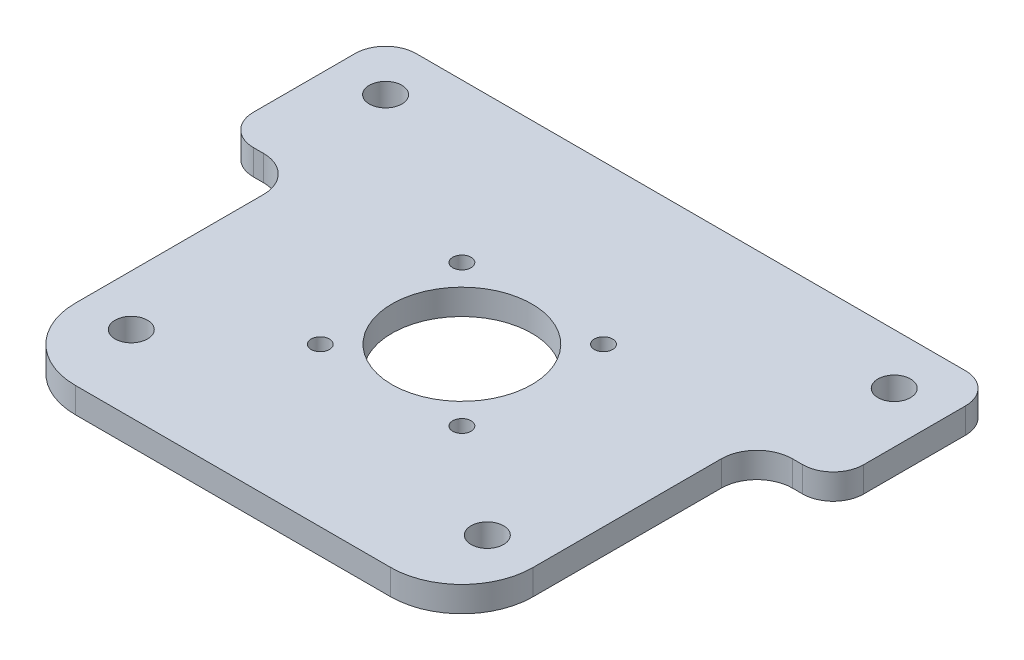
ISO-10303-21;
HEADER;
FILE_DESCRIPTION(('STEP AP214'),'2;1');
FILE_NAME('part.step','',(''),(''),'','','');
FILE_SCHEMA(('AUTOMOTIVE_DESIGN { 1 0 10303 214 1 1 1 1 }'));
ENDSEC;
DATA;
#1=APPLICATION_CONTEXT('core data for automotive mechanical design processes');
#2=APPLICATION_PROTOCOL_DEFINITION('international standard','automotive_design',2000,#1);
#3=PRODUCT_CONTEXT('',#1,'mechanical');
#4=PRODUCT('Part','Part','',(#3));
#5=PRODUCT_RELATED_PRODUCT_CATEGORY('part','',(#4));
#6=PRODUCT_DEFINITION_FORMATION('','',#4);
#7=PRODUCT_DEFINITION_CONTEXT('part definition',#1,'design');
#8=PRODUCT_DEFINITION('design','',#6,#7);
#9=PRODUCT_DEFINITION_SHAPE('','',#8);
#10=(LENGTH_UNIT() NAMED_UNIT(*) SI_UNIT(.MILLI.,.METRE.));
#11=(NAMED_UNIT(*) PLANE_ANGLE_UNIT() SI_UNIT($,.RADIAN.));
#12=(NAMED_UNIT(*) SI_UNIT($,.STERADIAN.) SOLID_ANGLE_UNIT());
#13=UNCERTAINTY_MEASURE_WITH_UNIT(LENGTH_MEASURE(1.E-05),#10,'distance_accuracy_value','');
#14=(GEOMETRIC_REPRESENTATION_CONTEXT(3) GLOBAL_UNCERTAINTY_ASSIGNED_CONTEXT((#13)) GLOBAL_UNIT_ASSIGNED_CONTEXT((#10,
#11,#12)) REPRESENTATION_CONTEXT('',''));
#15=CARTESIAN_POINT('',(0.,0.,0.));
#16=DIRECTION('',(0.,0.,1.));
#17=DIRECTION('',(1.,0.,0.));
#18=AXIS2_PLACEMENT_3D('',#15,#16,#17);
#19=CARTESIAN_POINT('',(-57.15,6.35,-57.15));
#20=DIRECTION('',(1.,0.,0.));
#21=DIRECTION('',(0.,0.,-1.));
#22=AXIS2_PLACEMENT_3D('',#19,#20,#21);
#23=PLANE('',#22);
#24=DIRECTION('',(0.,0.,1.));
#25=VECTOR('',#24,1.);
#26=CARTESIAN_POINT('',(-57.15,0.,-57.15));
#27=LINE('',#26,#25);
#28=CARTESIAN_POINT('',(-57.15,0.,-7.62));
#29=VERTEX_POINT('',#28);
#30=CARTESIAN_POINT('',(-57.15,0.,39.37));
#31=VERTEX_POINT('',#30);
#32=EDGE_CURVE('E212',#29,#31,#27,.T.);
#33=ORIENTED_EDGE('',*,*,#32,.T.);
#34=DIRECTION('',(0.,-1.,0.));
#35=VECTOR('',#34,1.);
#36=CARTESIAN_POINT('',(-57.15,6.35,39.37));
#37=LINE('',#36,#35);
#38=CARTESIAN_POINT('',(-57.15,6.35,39.37));
#39=VERTEX_POINT('',#38);
#40=EDGE_CURVE('E305',#31,#39,#37,.F.);
#41=ORIENTED_EDGE('',*,*,#40,.T.);
#42=DIRECTION('',(0.,0.,1.));
#43=VECTOR('',#42,1.);
#44=CARTESIAN_POINT('',(-57.15,6.35,-57.15));
#45=LINE('',#44,#43);
#46=CARTESIAN_POINT('',(-57.15,6.35,-7.62));
#47=VERTEX_POINT('',#46);
#48=EDGE_CURVE('E284',#47,#39,#45,.T.);
#49=ORIENTED_EDGE('',*,*,#48,.F.);
#50=DIRECTION('',(0.,1.,0.));
#51=VECTOR('',#50,1.);
#52=CARTESIAN_POINT('',(-57.15,6.35,-7.62));
#53=LINE('',#52,#51);
#54=EDGE_CURVE('E290',#47,#29,#53,.F.);
#55=ORIENTED_EDGE('',*,*,#54,.T.);
#56=EDGE_LOOP('',(#33,#41,#49,#55));
#57=FACE_BOUND('',#56,.T.);
#58=ADVANCED_FACE('F45',(#57),#23,.F.);
#59=CARTESIAN_POINT('',(57.15,6.35,-57.15));
#60=DIRECTION('',(1.,0.,0.));
#61=DIRECTION('',(0.,0.,-1.));
#62=AXIS2_PLACEMENT_3D('',#59,#60,#61);
#63=PLANE('',#62);
#64=DIRECTION('',(0.,0.,1.));
#65=VECTOR('',#64,1.);
#66=CARTESIAN_POINT('',(57.15,6.35,-57.15));
#67=LINE('',#66,#65);
#68=CARTESIAN_POINT('',(57.15,6.35,-7.62));
#69=VERTEX_POINT('',#68);
#70=CARTESIAN_POINT('',(57.15,6.35,39.37));
#71=VERTEX_POINT('',#70);
#72=EDGE_CURVE('E190',#69,#71,#67,.T.);
#73=ORIENTED_EDGE('',*,*,#72,.T.);
#74=DIRECTION('',(0.,-1.,0.));
#75=VECTOR('',#74,1.);
#76=CARTESIAN_POINT('',(57.15,0.,39.37));
#77=LINE('',#76,#75);
#78=CARTESIAN_POINT('',(57.15,0.,39.37));
#79=VERTEX_POINT('',#78);
#80=EDGE_CURVE('E180',#71,#79,#77,.T.);
#81=ORIENTED_EDGE('',*,*,#80,.T.);
#82=DIRECTION('',(0.,0.,1.));
#83=VECTOR('',#82,1.);
#84=CARTESIAN_POINT('',(57.15,0.,-57.15));
#85=LINE('',#84,#83);
#86=CARTESIAN_POINT('',(57.15,0.,-7.62));
#87=VERTEX_POINT('',#86);
#88=EDGE_CURVE('E162',#87,#79,#85,.T.);
#89=ORIENTED_EDGE('',*,*,#88,.F.);
#90=DIRECTION('',(0.,1.,0.));
#91=VECTOR('',#90,1.);
#92=CARTESIAN_POINT('',(57.15,6.34999999999999,-7.62));
#93=LINE('',#92,#91);
#94=EDGE_CURVE('E177',#87,#69,#93,.T.);
#95=ORIENTED_EDGE('',*,*,#94,.T.);
#96=EDGE_LOOP('',(#73,#81,#89,#95));
#97=FACE_BOUND('',#96,.T.);
#98=ADVANCED_FACE('F176',(#97),#63,.T.);
#99=CARTESIAN_POINT('',(-57.15,6.35,57.15));
#100=DIRECTION('',(0.,0.,-1.));
#101=DIRECTION('',(-1.,0.,0.));
#102=AXIS2_PLACEMENT_3D('',#99,#100,#101);
#103=PLANE('',#102);
#104=DIRECTION('',(1.,0.,0.));
#105=VECTOR('',#104,1.);
#106=CARTESIAN_POINT('',(-57.15,6.35,57.15));
#107=LINE('',#106,#105);
#108=CARTESIAN_POINT('',(-39.37,6.35,57.15));
#109=VERTEX_POINT('',#108);
#110=CARTESIAN_POINT('',(39.37,6.35,57.15));
#111=VERTEX_POINT('',#110);
#112=EDGE_CURVE('E282',#109,#111,#107,.T.);
#113=ORIENTED_EDGE('',*,*,#112,.F.);
#114=DIRECTION('',(0.,-1.,0.));
#115=VECTOR('',#114,1.);
#116=CARTESIAN_POINT('',(-39.37,6.35,57.15));
#117=LINE('',#116,#115);
#118=CARTESIAN_POINT('',(-39.37,0.,57.15));
#119=VERTEX_POINT('',#118);
#120=EDGE_CURVE('E298',#109,#119,#117,.T.);
#121=ORIENTED_EDGE('',*,*,#120,.T.);
#122=DIRECTION('',(1.,0.,0.));
#123=VECTOR('',#122,1.);
#124=CARTESIAN_POINT('',(-57.15,0.,57.15));
#125=LINE('',#124,#123);
#126=CARTESIAN_POINT('',(39.37,0.,57.15));
#127=VERTEX_POINT('',#126);
#128=EDGE_CURVE('E182',#119,#127,#125,.T.);
#129=ORIENTED_EDGE('',*,*,#128,.T.);
#130=DIRECTION('',(0.,-1.,0.));
#131=VECTOR('',#130,1.);
#132=CARTESIAN_POINT('',(39.37,6.35,57.15));
#133=LINE('',#132,#131);
#134=EDGE_CURVE('E296',#127,#111,#133,.F.);
#135=ORIENTED_EDGE('',*,*,#134,.T.);
#136=EDGE_LOOP('',(#113,#121,#129,#135));
#137=FACE_BOUND('',#136,.T.);
#138=ADVANCED_FACE('F318',(#137),#103,.F.);
#139=CARTESIAN_POINT('',(-57.15,6.35,-57.15));
#140=DIRECTION('',(0.,0.,-1.));
#141=DIRECTION('',(-1.,0.,0.));
#142=AXIS2_PLACEMENT_3D('',#139,#140,#141);
#143=PLANE('',#142);
#144=DIRECTION('',(1.,0.,0.));
#145=VECTOR('',#144,1.);
#146=CARTESIAN_POINT('',(-57.15,6.35,-57.15));
#147=LINE('',#146,#145);
#148=CARTESIAN_POINT('',(-68.58,6.35,-57.15));
#149=VERTEX_POINT('',#148);
#150=CARTESIAN_POINT('',(68.58,6.35,-57.15));
#151=VERTEX_POINT('',#150);
#152=EDGE_CURVE('E186',#149,#151,#147,.T.);
#153=ORIENTED_EDGE('',*,*,#152,.T.);
#154=DIRECTION('',(0.,1.,0.));
#155=VECTOR('',#154,1.);
#156=CARTESIAN_POINT('',(68.58,6.35,-57.15));
#157=LINE('',#156,#155);
#158=CARTESIAN_POINT('',(68.58,0.,-57.15));
#159=VERTEX_POINT('',#158);
#160=EDGE_CURVE('E60',#151,#159,#157,.F.);
#161=ORIENTED_EDGE('',*,*,#160,.T.);
#162=DIRECTION('',(1.,0.,0.));
#163=VECTOR('',#162,1.);
#164=CARTESIAN_POINT('',(-57.15,0.,-57.15));
#165=LINE('',#164,#163);
#166=CARTESIAN_POINT('',(-68.58,0.,-57.15));
#167=VERTEX_POINT('',#166);
#168=EDGE_CURVE('E181',#167,#159,#165,.T.);
#169=ORIENTED_EDGE('',*,*,#168,.F.);
#170=DIRECTION('',(0.,1.,0.));
#171=VECTOR('',#170,1.);
#172=CARTESIAN_POINT('',(-68.58,6.35,-57.15));
#173=LINE('',#172,#171);
#174=EDGE_CURVE('E242',#167,#149,#173,.T.);
#175=ORIENTED_EDGE('',*,*,#174,.T.);
#176=EDGE_LOOP('',(#153,#161,#169,#175));
#177=FACE_BOUND('',#176,.T.);
#178=ADVANCED_FACE('F262',(#177),#143,.T.);
#179=CARTESIAN_POINT('',(0.,6.35,0.));
#180=DIRECTION('',(0.,1.,0.));
#181=DIRECTION('',(0.,0.,1.));
#182=AXIS2_PLACEMENT_3D('',#179,#180,#181);
#183=PLANE('',#182);
#184=CARTESIAN_POINT('',(-17.6776695296637,6.35,17.6776695296637));
#185=DIRECTION('',(0.,1.,0.));
#186=DIRECTION('',(0.,0.,1.));
#187=AXIS2_PLACEMENT_3D('',#184,#185,#186);
#188=CIRCLE('',#187,2.286);
#189=CARTESIAN_POINT('',(-17.6776695296637,6.35,19.9636695296637));
#190=VERTEX_POINT('',#189);
#191=EDGE_CURVE('E336',#190,#190,#188,.T.);
#192=ORIENTED_EDGE('',*,*,#191,.F.);
#193=EDGE_LOOP('',(#192));
#194=FACE_BOUND('',#193,.T.);
#195=CARTESIAN_POINT('',(17.6776695296637,6.35,17.6776695296637));
#196=DIRECTION('',(0.,1.,0.));
#197=DIRECTION('',(0.,0.,1.));
#198=AXIS2_PLACEMENT_3D('',#195,#196,#197);
#199=CIRCLE('',#198,2.286);
#200=CARTESIAN_POINT('',(17.6776695296637,6.35,19.9636695296637));
#201=VERTEX_POINT('',#200);
#202=EDGE_CURVE('E335',#201,#201,#199,.T.);
#203=ORIENTED_EDGE('',*,*,#202,.F.);
#204=EDGE_LOOP('',(#203));
#205=FACE_BOUND('',#204,.T.);
#206=CARTESIAN_POINT('',(17.6776695296637,6.35,-17.6776695296637));
#207=DIRECTION('',(0.,1.,0.));
#208=DIRECTION('',(0.,0.,1.));
#209=AXIS2_PLACEMENT_3D('',#206,#207,#208);
#210=CIRCLE('',#209,2.286);
#211=CARTESIAN_POINT('',(17.6776695296637,6.35,-15.3916695296637));
#212=VERTEX_POINT('',#211);
#213=EDGE_CURVE('E340',#212,#212,#210,.T.);
#214=ORIENTED_EDGE('',*,*,#213,.F.);
#215=EDGE_LOOP('',(#214));
#216=FACE_BOUND('',#215,.T.);
#217=CARTESIAN_POINT('',(-17.6776695296637,6.35,-17.6776695296637));
#218=DIRECTION('',(0.,1.,0.));
#219=DIRECTION('',(0.,0.,1.));
#220=AXIS2_PLACEMENT_3D('',#217,#218,#219);
#221=CIRCLE('',#220,2.286);
#222=CARTESIAN_POINT('',(-17.6776695296637,6.35,-15.3916695296637));
#223=VERTEX_POINT('',#222);
#224=EDGE_CURVE('E344',#223,#223,#221,.T.);
#225=ORIENTED_EDGE('',*,*,#224,.F.);
#226=EDGE_LOOP('',(#225));
#227=FACE_BOUND('',#226,.T.);
#228=CARTESIAN_POINT('',(0.,6.35,0.));
#229=DIRECTION('',(0.,1.,0.));
#230=DIRECTION('',(0.,0.,1.));
#231=AXIS2_PLACEMENT_3D('',#228,#229,#230);
#232=CIRCLE('',#231,17.4625);
#233=CARTESIAN_POINT('',(0.,6.35,17.4625));
#234=VERTEX_POINT('',#233);
#235=EDGE_CURVE('E348',#234,#234,#232,.T.);
#236=ORIENTED_EDGE('',*,*,#235,.F.);
#237=EDGE_LOOP('',(#236));
#238=FACE_BOUND('',#237,.T.);
#239=CARTESIAN_POINT('',(-44.45,6.35,38.1));
#240=DIRECTION('',(0.,1.,0.));
#241=DIRECTION('',(0.,0.,1.));
#242=AXIS2_PLACEMENT_3D('',#239,#240,#241);
#243=CIRCLE('',#242,4.06400000000001);
#244=CARTESIAN_POINT('',(-44.45,6.35,42.164));
#245=VERTEX_POINT('',#244);
#246=EDGE_CURVE('E352',#245,#245,#243,.T.);
#247=ORIENTED_EDGE('',*,*,#246,.F.);
#248=EDGE_LOOP('',(#247));
#249=FACE_BOUND('',#248,.T.);
#250=CARTESIAN_POINT('',(44.45,6.35,38.1));
#251=DIRECTION('',(0.,1.,0.));
#252=DIRECTION('',(0.,0.,1.));
#253=AXIS2_PLACEMENT_3D('',#250,#251,#252);
#254=CIRCLE('',#253,4.06400000000001);
#255=CARTESIAN_POINT('',(44.45,6.35,42.164));
#256=VERTEX_POINT('',#255);
#257=EDGE_CURVE('E356',#256,#256,#254,.T.);
#258=ORIENTED_EDGE('',*,*,#257,.F.);
#259=EDGE_LOOP('',(#258));
#260=FACE_BOUND('',#259,.T.);
#261=CARTESIAN_POINT('',(63.5,6.35,-44.45));
#262=DIRECTION('',(0.,1.,0.));
#263=DIRECTION('',(0.,0.,1.));
#264=AXIS2_PLACEMENT_3D('',#261,#262,#263);
#265=CIRCLE('',#264,4.064);
#266=CARTESIAN_POINT('',(63.5,6.35,-40.386));
#267=VERTEX_POINT('',#266);
#268=EDGE_CURVE('E360',#267,#267,#265,.T.);
#269=ORIENTED_EDGE('',*,*,#268,.F.);
#270=EDGE_LOOP('',(#269));
#271=FACE_BOUND('',#270,.T.);
#272=CARTESIAN_POINT('',(-63.5,6.35,-44.45));
#273=DIRECTION('',(0.,1.,0.));
#274=DIRECTION('',(0.,0.,1.));
#275=AXIS2_PLACEMENT_3D('',#272,#273,#274);
#276=CIRCLE('',#275,4.064);
#277=CARTESIAN_POINT('',(-63.5,6.35,-40.386));
#278=VERTEX_POINT('',#277);
#279=EDGE_CURVE('E364',#278,#278,#276,.T.);
#280=ORIENTED_EDGE('',*,*,#279,.F.);
#281=EDGE_LOOP('',(#280));
#282=FACE_BOUND('',#281,.T.);
#283=DIRECTION('',(1.,0.,0.));
#284=VECTOR('',#283,1.);
#285=CARTESIAN_POINT('',(57.15,6.35,-16.51));
#286=LINE('',#285,#284);
#287=CARTESIAN_POINT('',(66.04,6.35,-16.51));
#288=VERTEX_POINT('',#287);
#289=CARTESIAN_POINT('',(68.58,6.35,-16.51));
#290=VERTEX_POINT('',#289);
#291=EDGE_CURVE('E195',#288,#290,#286,.T.);
#292=ORIENTED_EDGE('',*,*,#291,.T.);
#293=CARTESIAN_POINT('',(68.58,6.35,-24.13));
#294=DIRECTION('',(0.,1.,0.));
#295=DIRECTION('',(0.,0.,1.));
#296=AXIS2_PLACEMENT_3D('',#293,#294,#295);
#297=CIRCLE('',#296,7.62);
#298=CARTESIAN_POINT('',(76.2,6.35,-24.13));
#299=VERTEX_POINT('',#298);
#300=EDGE_CURVE('E228',#290,#299,#297,.T.);
#301=ORIENTED_EDGE('',*,*,#300,.T.);
#302=DIRECTION('',(0.,0.,-1.));
#303=VECTOR('',#302,1.);
#304=CARTESIAN_POINT('',(76.2,6.35,-16.51));
#305=LINE('',#304,#303);
#306=CARTESIAN_POINT('',(76.2,6.35,-49.53));
#307=VERTEX_POINT('',#306);
#308=EDGE_CURVE('E198',#299,#307,#305,.T.);
#309=ORIENTED_EDGE('',*,*,#308,.T.);
#310=CARTESIAN_POINT('',(68.58,6.35,-49.53));
#311=DIRECTION('',(0.,1.,0.));
#312=DIRECTION('',(0.,0.,1.));
#313=AXIS2_PLACEMENT_3D('',#310,#311,#312);
#314=CIRCLE('',#313,7.62);
#315=EDGE_CURVE('E226',#307,#151,#314,.T.);
#316=ORIENTED_EDGE('',*,*,#315,.T.);
#317=ORIENTED_EDGE('',*,*,#152,.F.);
#318=CARTESIAN_POINT('',(-68.58,6.35,-49.53));
#319=DIRECTION('',(0.,1.,0.));
#320=DIRECTION('',(0.,0.,1.));
#321=AXIS2_PLACEMENT_3D('',#318,#319,#320);
#322=CIRCLE('',#321,7.62);
#323=CARTESIAN_POINT('',(-76.2,6.35,-49.53));
#324=VERTEX_POINT('',#323);
#325=EDGE_CURVE('E224',#149,#324,#322,.T.);
#326=ORIENTED_EDGE('',*,*,#325,.T.);
#327=DIRECTION('',(0.,0.,1.));
#328=VECTOR('',#327,1.);
#329=CARTESIAN_POINT('',(-76.2,6.35,-16.51));
#330=LINE('',#329,#328);
#331=CARTESIAN_POINT('',(-76.2,6.35,-24.13));
#332=VERTEX_POINT('',#331);
#333=EDGE_CURVE('E222',#324,#332,#330,.T.);
#334=ORIENTED_EDGE('',*,*,#333,.T.);
#335=CARTESIAN_POINT('',(-68.58,6.35,-24.13));
#336=DIRECTION('',(0.,1.,0.));
#337=DIRECTION('',(0.,0.,1.));
#338=AXIS2_PLACEMENT_3D('',#335,#336,#337);
#339=CIRCLE('',#338,7.62);
#340=CARTESIAN_POINT('',(-68.58,6.35,-16.51));
#341=VERTEX_POINT('',#340);
#342=EDGE_CURVE('E218',#332,#341,#339,.T.);
#343=ORIENTED_EDGE('',*,*,#342,.T.);
#344=DIRECTION('',(1.,0.,0.));
#345=VECTOR('',#344,1.);
#346=CARTESIAN_POINT('',(-57.15,6.35,-16.51));
#347=LINE('',#346,#345);
#348=CARTESIAN_POINT('',(-66.04,6.35,-16.51));
#349=VERTEX_POINT('',#348);
#350=EDGE_CURVE('E219',#341,#349,#347,.T.);
#351=ORIENTED_EDGE('',*,*,#350,.T.);
#352=CARTESIAN_POINT('',(-66.04,6.35,-7.62));
#353=DIRECTION('',(0.,1.,0.));
#354=DIRECTION('',(0.,0.,1.));
#355=AXIS2_PLACEMENT_3D('',#352,#353,#354);
#356=CIRCLE('',#355,8.89);
#357=EDGE_CURVE('E169',#349,#47,#356,.F.);
#358=ORIENTED_EDGE('',*,*,#357,.T.);
#359=ORIENTED_EDGE('',*,*,#48,.T.);
#360=CARTESIAN_POINT('',(-39.37,6.35,39.37));
#361=DIRECTION('',(0.,1.,0.));
#362=DIRECTION('',(0.,0.,1.));
#363=AXIS2_PLACEMENT_3D('',#360,#361,#362);
#364=CIRCLE('',#363,17.78);
#365=EDGE_CURVE('E308',#39,#109,#364,.T.);
#366=ORIENTED_EDGE('',*,*,#365,.T.);
#367=ORIENTED_EDGE('',*,*,#112,.T.);
#368=CARTESIAN_POINT('',(39.37,6.35,39.37));
#369=DIRECTION('',(0.,1.,0.));
#370=DIRECTION('',(0.,0.,1.));
#371=AXIS2_PLACEMENT_3D('',#368,#369,#370);
#372=CIRCLE('',#371,17.78);
#373=EDGE_CURVE('E307',#111,#71,#372,.T.);
#374=ORIENTED_EDGE('',*,*,#373,.T.);
#375=ORIENTED_EDGE('',*,*,#72,.F.);
#376=CARTESIAN_POINT('',(66.04,6.35,-7.62));
#377=DIRECTION('',(0.,1.,0.));
#378=DIRECTION('',(0.,0.,1.));
#379=AXIS2_PLACEMENT_3D('',#376,#377,#378);
#380=CIRCLE('',#379,8.89);
#381=EDGE_CURVE('E170',#69,#288,#380,.F.);
#382=ORIENTED_EDGE('',*,*,#381,.T.);
#383=EDGE_LOOP('',(#292,#301,#309,#316,#317,#326,#334,#343,#351,#358,#359,#366,#367,#374,#375,#382));
#384=FACE_BOUND('',#383,.T.);
#385=ADVANCED_FACE('F264',(#194,#205,#216,#227,#238,#249,#260,#271,#282,#384),#183,.T.);
#386=CARTESIAN_POINT('',(0.,0.,0.));
#387=DIRECTION('',(0.,1.,0.));
#388=DIRECTION('',(0.,0.,1.));
#389=AXIS2_PLACEMENT_3D('',#386,#387,#388);
#390=PLANE('',#389);
#391=CARTESIAN_POINT('',(-17.6776695296637,0.,17.6776695296637));
#392=DIRECTION('',(0.,1.,0.));
#393=DIRECTION('',(0.,0.,1.));
#394=AXIS2_PLACEMENT_3D('',#391,#392,#393);
#395=CIRCLE('',#394,2.286);
#396=CARTESIAN_POINT('',(-17.6776695296637,0.,19.9636695296637));
#397=VERTEX_POINT('',#396);
#398=EDGE_CURVE('E332',#397,#397,#395,.T.);
#399=ORIENTED_EDGE('',*,*,#398,.T.);
#400=EDGE_LOOP('',(#399));
#401=FACE_BOUND('',#400,.T.);
#402=CARTESIAN_POINT('',(17.6776695296637,0.,17.6776695296637));
#403=DIRECTION('',(0.,1.,0.));
#404=DIRECTION('',(0.,0.,1.));
#405=AXIS2_PLACEMENT_3D('',#402,#403,#404);
#406=CIRCLE('',#405,2.286);
#407=CARTESIAN_POINT('',(17.6776695296637,0.,19.9636695296637));
#408=VERTEX_POINT('',#407);
#409=EDGE_CURVE('E337',#408,#408,#406,.T.);
#410=ORIENTED_EDGE('',*,*,#409,.T.);
#411=EDGE_LOOP('',(#410));
#412=FACE_BOUND('',#411,.T.);
#413=CARTESIAN_POINT('',(17.6776695296637,0.,-17.6776695296637));
#414=DIRECTION('',(0.,1.,0.));
#415=DIRECTION('',(0.,0.,1.));
#416=AXIS2_PLACEMENT_3D('',#413,#414,#415);
#417=CIRCLE('',#416,2.286);
#418=CARTESIAN_POINT('',(17.6776695296637,0.,-15.3916695296637));
#419=VERTEX_POINT('',#418);
#420=EDGE_CURVE('E341',#419,#419,#417,.T.);
#421=ORIENTED_EDGE('',*,*,#420,.T.);
#422=EDGE_LOOP('',(#421));
#423=FACE_BOUND('',#422,.T.);
#424=CARTESIAN_POINT('',(-17.6776695296637,0.,-17.6776695296637));
#425=DIRECTION('',(0.,1.,0.));
#426=DIRECTION('',(0.,0.,1.));
#427=AXIS2_PLACEMENT_3D('',#424,#425,#426);
#428=CIRCLE('',#427,2.286);
#429=CARTESIAN_POINT('',(-17.6776695296637,0.,-15.3916695296637));
#430=VERTEX_POINT('',#429);
#431=EDGE_CURVE('E345',#430,#430,#428,.T.);
#432=ORIENTED_EDGE('',*,*,#431,.T.);
#433=EDGE_LOOP('',(#432));
#434=FACE_BOUND('',#433,.T.);
#435=CARTESIAN_POINT('',(0.,0.,0.));
#436=DIRECTION('',(0.,1.,0.));
#437=DIRECTION('',(0.,0.,1.));
#438=AXIS2_PLACEMENT_3D('',#435,#436,#437);
#439=CIRCLE('',#438,17.4625);
#440=CARTESIAN_POINT('',(0.,0.,17.4625));
#441=VERTEX_POINT('',#440);
#442=EDGE_CURVE('E349',#441,#441,#439,.T.);
#443=ORIENTED_EDGE('',*,*,#442,.T.);
#444=EDGE_LOOP('',(#443));
#445=FACE_BOUND('',#444,.T.);
#446=CARTESIAN_POINT('',(-44.45,0.,38.1));
#447=DIRECTION('',(0.,1.,0.));
#448=DIRECTION('',(0.,0.,1.));
#449=AXIS2_PLACEMENT_3D('',#446,#447,#448);
#450=CIRCLE('',#449,4.06400000000001);
#451=CARTESIAN_POINT('',(-44.45,0.,42.164));
#452=VERTEX_POINT('',#451);
#453=EDGE_CURVE('E353',#452,#452,#450,.T.);
#454=ORIENTED_EDGE('',*,*,#453,.T.);
#455=EDGE_LOOP('',(#454));
#456=FACE_BOUND('',#455,.T.);
#457=CARTESIAN_POINT('',(44.45,0.,38.1));
#458=DIRECTION('',(0.,1.,0.));
#459=DIRECTION('',(0.,0.,1.));
#460=AXIS2_PLACEMENT_3D('',#457,#458,#459);
#461=CIRCLE('',#460,4.06400000000001);
#462=CARTESIAN_POINT('',(44.45,0.,42.164));
#463=VERTEX_POINT('',#462);
#464=EDGE_CURVE('E357',#463,#463,#461,.T.);
#465=ORIENTED_EDGE('',*,*,#464,.T.);
#466=EDGE_LOOP('',(#465));
#467=FACE_BOUND('',#466,.T.);
#468=CARTESIAN_POINT('',(63.5,0.,-44.45));
#469=DIRECTION('',(0.,1.,0.));
#470=DIRECTION('',(0.,0.,1.));
#471=AXIS2_PLACEMENT_3D('',#468,#469,#470);
#472=CIRCLE('',#471,4.064);
#473=CARTESIAN_POINT('',(63.5,0.,-40.386));
#474=VERTEX_POINT('',#473);
#475=EDGE_CURVE('E361',#474,#474,#472,.T.);
#476=ORIENTED_EDGE('',*,*,#475,.T.);
#477=EDGE_LOOP('',(#476));
#478=FACE_BOUND('',#477,.T.);
#479=CARTESIAN_POINT('',(-63.5,0.,-44.45));
#480=DIRECTION('',(0.,1.,0.));
#481=DIRECTION('',(0.,0.,1.));
#482=AXIS2_PLACEMENT_3D('',#479,#480,#481);
#483=CIRCLE('',#482,4.064);
#484=CARTESIAN_POINT('',(-63.5,0.,-40.386));
#485=VERTEX_POINT('',#484);
#486=EDGE_CURVE('E365',#485,#485,#483,.T.);
#487=ORIENTED_EDGE('',*,*,#486,.T.);
#488=EDGE_LOOP('',(#487));
#489=FACE_BOUND('',#488,.T.);
#490=DIRECTION('',(0.,0.,1.));
#491=VECTOR('',#490,1.);
#492=CARTESIAN_POINT('',(76.2,0.,-16.51));
#493=LINE('',#492,#491);
#494=CARTESIAN_POINT('',(76.2,0.,-49.53));
#495=VERTEX_POINT('',#494);
#496=CARTESIAN_POINT('',(76.2,0.,-24.13));
#497=VERTEX_POINT('',#496);
#498=EDGE_CURVE('E213',#495,#497,#493,.T.);
#499=ORIENTED_EDGE('',*,*,#498,.T.);
#500=CARTESIAN_POINT('',(68.58,0.,-24.13));
#501=DIRECTION('',(0.,1.,0.));
#502=DIRECTION('',(0.,0.,1.));
#503=AXIS2_PLACEMENT_3D('',#500,#501,#502);
#504=CIRCLE('',#503,7.62);
#505=CARTESIAN_POINT('',(68.58,0.,-16.51));
#506=VERTEX_POINT('',#505);
#507=EDGE_CURVE('E240',#497,#506,#504,.F.);
#508=ORIENTED_EDGE('',*,*,#507,.T.);
#509=DIRECTION('',(-1.,0.,0.));
#510=VECTOR('',#509,1.);
#511=CARTESIAN_POINT('',(57.15,0.,-16.51));
#512=LINE('',#511,#510);
#513=CARTESIAN_POINT('',(66.04,0.,-16.51));
#514=VERTEX_POINT('',#513);
#515=EDGE_CURVE('E164',#506,#514,#512,.T.);
#516=ORIENTED_EDGE('',*,*,#515,.T.);
#517=CARTESIAN_POINT('',(66.04,0.,-7.62));
#518=DIRECTION('',(0.,1.,0.));
#519=DIRECTION('',(0.,0.,1.));
#520=AXIS2_PLACEMENT_3D('',#517,#518,#519);
#521=CIRCLE('',#520,8.89);
#522=EDGE_CURVE('E158',#514,#87,#521,.T.);
#523=ORIENTED_EDGE('',*,*,#522,.T.);
#524=ORIENTED_EDGE('',*,*,#88,.T.);
#525=CARTESIAN_POINT('',(39.37,0.,39.37));
#526=DIRECTION('',(0.,1.,0.));
#527=DIRECTION('',(0.,0.,1.));
#528=AXIS2_PLACEMENT_3D('',#525,#526,#527);
#529=CIRCLE('',#528,17.78);
#530=EDGE_CURVE('E301',#79,#127,#529,.F.);
#531=ORIENTED_EDGE('',*,*,#530,.T.);
#532=ORIENTED_EDGE('',*,*,#128,.F.);
#533=CARTESIAN_POINT('',(-39.37,0.,39.37));
#534=DIRECTION('',(0.,1.,0.));
#535=DIRECTION('',(0.,0.,1.));
#536=AXIS2_PLACEMENT_3D('',#533,#534,#535);
#537=CIRCLE('',#536,17.78);
#538=EDGE_CURVE('E303',#119,#31,#537,.F.);
#539=ORIENTED_EDGE('',*,*,#538,.T.);
#540=ORIENTED_EDGE('',*,*,#32,.F.);
#541=CARTESIAN_POINT('',(-66.04,0.,-7.62));
#542=DIRECTION('',(0.,1.,0.));
#543=DIRECTION('',(0.,0.,1.));
#544=AXIS2_PLACEMENT_3D('',#541,#542,#543);
#545=CIRCLE('',#544,8.89);
#546=CARTESIAN_POINT('',(-66.04,0.,-16.51));
#547=VERTEX_POINT('',#546);
#548=EDGE_CURVE('E294',#29,#547,#545,.T.);
#549=ORIENTED_EDGE('',*,*,#548,.T.);
#550=DIRECTION('',(-1.,0.,0.));
#551=VECTOR('',#550,1.);
#552=CARTESIAN_POINT('',(-57.15,0.,-16.51));
#553=LINE('',#552,#551);
#554=CARTESIAN_POINT('',(-68.58,0.,-16.51));
#555=VERTEX_POINT('',#554);
#556=EDGE_CURVE('E199',#547,#555,#553,.T.);
#557=ORIENTED_EDGE('',*,*,#556,.T.);
#558=CARTESIAN_POINT('',(-68.58,0.,-24.13));
#559=DIRECTION('',(0.,1.,0.));
#560=DIRECTION('',(0.,0.,1.));
#561=AXIS2_PLACEMENT_3D('',#558,#559,#560);
#562=CIRCLE('',#561,7.62);
#563=CARTESIAN_POINT('',(-76.2,0.,-24.13));
#564=VERTEX_POINT('',#563);
#565=EDGE_CURVE('E235',#555,#564,#562,.F.);
#566=ORIENTED_EDGE('',*,*,#565,.T.);
#567=DIRECTION('',(0.,0.,-1.));
#568=VECTOR('',#567,1.);
#569=CARTESIAN_POINT('',(-76.2,0.,-16.51));
#570=LINE('',#569,#568);
#571=CARTESIAN_POINT('',(-76.2,0.,-49.53));
#572=VERTEX_POINT('',#571);
#573=EDGE_CURVE('E221',#564,#572,#570,.T.);
#574=ORIENTED_EDGE('',*,*,#573,.T.);
#575=CARTESIAN_POINT('',(-68.58,0.,-49.53));
#576=DIRECTION('',(0.,1.,0.));
#577=DIRECTION('',(0.,0.,1.));
#578=AXIS2_PLACEMENT_3D('',#575,#576,#577);
#579=CIRCLE('',#578,7.62);
#580=EDGE_CURVE('E67',#572,#167,#579,.F.);
#581=ORIENTED_EDGE('',*,*,#580,.T.);
#582=ORIENTED_EDGE('',*,*,#168,.T.);
#583=CARTESIAN_POINT('',(68.58,0.,-49.53));
#584=DIRECTION('',(0.,1.,0.));
#585=DIRECTION('',(0.,0.,1.));
#586=AXIS2_PLACEMENT_3D('',#583,#584,#585);
#587=CIRCLE('',#586,7.62);
#588=EDGE_CURVE('E238',#159,#495,#587,.F.);
#589=ORIENTED_EDGE('',*,*,#588,.T.);
#590=EDGE_LOOP('',(#499,#508,#516,#523,#524,#531,#532,#539,#540,#549,#557,#566,#574,#581,#582,#589));
#591=FACE_BOUND('',#590,.T.);
#592=ADVANCED_FACE('F161',(#401,#412,#423,#434,#445,#456,#467,#478,#489,#591),#390,.F.);
#593=CARTESIAN_POINT('',(76.2,-44.8833164995636,-16.51));
#594=DIRECTION('',(1.,0.,0.));
#595=DIRECTION('',(0.,0.,-1.));
#596=AXIS2_PLACEMENT_3D('',#593,#594,#595);
#597=PLANE('',#596);
#598=ORIENTED_EDGE('',*,*,#308,.F.);
#599=DIRECTION('',(0.,1.,0.));
#600=VECTOR('',#599,1.);
#601=CARTESIAN_POINT('',(76.2,-44.8833164995636,-24.13));
#602=LINE('',#601,#600);
#603=EDGE_CURVE('E233',#299,#497,#602,.F.);
#604=ORIENTED_EDGE('',*,*,#603,.T.);
#605=ORIENTED_EDGE('',*,*,#498,.F.);
#606=DIRECTION('',(0.,1.,0.));
#607=VECTOR('',#606,1.);
#608=CARTESIAN_POINT('',(76.2,-44.8833164995636,-49.53));
#609=LINE('',#608,#607);
#610=EDGE_CURVE('E230',#495,#307,#609,.T.);
#611=ORIENTED_EDGE('',*,*,#610,.T.);
#612=EDGE_LOOP('',(#598,#604,#605,#611));
#613=FACE_BOUND('',#612,.T.);
#614=ADVANCED_FACE('F273',(#613),#597,.T.);
#615=CARTESIAN_POINT('',(57.15,-44.8833164995636,-16.51));
#616=DIRECTION('',(0.,0.,1.));
#617=DIRECTION('',(1.,0.,0.));
#618=AXIS2_PLACEMENT_3D('',#615,#616,#617);
#619=PLANE('',#618);
#620=ORIENTED_EDGE('',*,*,#515,.F.);
#621=DIRECTION('',(0.,1.,0.));
#622=VECTOR('',#621,1.);
#623=CARTESIAN_POINT('',(68.58,-44.8833164995636,-16.51));
#624=LINE('',#623,#622);
#625=EDGE_CURVE('E215',#506,#290,#624,.T.);
#626=ORIENTED_EDGE('',*,*,#625,.T.);
#627=ORIENTED_EDGE('',*,*,#291,.F.);
#628=DIRECTION('',(0.,1.,0.));
#629=VECTOR('',#628,1.);
#630=CARTESIAN_POINT('',(66.04,0.,-16.51));
#631=LINE('',#630,#629);
#632=EDGE_CURVE('E185',#288,#514,#631,.F.);
#633=ORIENTED_EDGE('',*,*,#632,.T.);
#634=EDGE_LOOP('',(#620,#626,#627,#633));
#635=FACE_BOUND('',#634,.T.);
#636=ADVANCED_FACE('F544',(#635),#619,.T.);
#637=CARTESIAN_POINT('',(-57.15,-44.8833164995636,-16.51));
#638=DIRECTION('',(0.,0.,1.));
#639=DIRECTION('',(1.,0.,0.));
#640=AXIS2_PLACEMENT_3D('',#637,#638,#639);
#641=PLANE('',#640);
#642=ORIENTED_EDGE('',*,*,#350,.F.);
#643=DIRECTION('',(0.,1.,0.));
#644=VECTOR('',#643,1.);
#645=CARTESIAN_POINT('',(-68.58,-44.8833164995636,-16.51));
#646=LINE('',#645,#644);
#647=EDGE_CURVE('E13',#341,#555,#646,.F.);
#648=ORIENTED_EDGE('',*,*,#647,.T.);
#649=ORIENTED_EDGE('',*,*,#556,.F.);
#650=DIRECTION('',(0.,1.,0.));
#651=VECTOR('',#650,1.);
#652=CARTESIAN_POINT('',(-66.04,-44.8833164995636,-16.51));
#653=LINE('',#652,#651);
#654=EDGE_CURVE('E188',#547,#349,#653,.T.);
#655=ORIENTED_EDGE('',*,*,#654,.T.);
#656=EDGE_LOOP('',(#642,#648,#649,#655));
#657=FACE_BOUND('',#656,.T.);
#658=ADVANCED_FACE('F373',(#657),#641,.T.);
#659=CARTESIAN_POINT('',(-76.2,-44.8833164995636,-16.51));
#660=DIRECTION('',(-1.,0.,0.));
#661=DIRECTION('',(0.,0.,1.));
#662=AXIS2_PLACEMENT_3D('',#659,#660,#661);
#663=PLANE('',#662);
#664=ORIENTED_EDGE('',*,*,#333,.F.);
#665=DIRECTION('',(0.,1.,0.));
#666=VECTOR('',#665,1.);
#667=CARTESIAN_POINT('',(-76.2,-44.8833164995636,-49.53));
#668=LINE('',#667,#666);
#669=EDGE_CURVE('E53',#324,#572,#668,.F.);
#670=ORIENTED_EDGE('',*,*,#669,.T.);
#671=ORIENTED_EDGE('',*,*,#573,.F.);
#672=DIRECTION('',(0.,1.,0.));
#673=VECTOR('',#672,1.);
#674=CARTESIAN_POINT('',(-76.2,-44.8833164995636,-24.13));
#675=LINE('',#674,#673);
#676=EDGE_CURVE('E246',#564,#332,#675,.T.);
#677=ORIENTED_EDGE('',*,*,#676,.T.);
#678=EDGE_LOOP('',(#664,#670,#671,#677));
#679=FACE_BOUND('',#678,.T.);
#680=ADVANCED_FACE('F252',(#679),#663,.T.);
#681=CARTESIAN_POINT('',(-63.5,-4.99999999997031E-05,-44.45));
#682=DIRECTION('',(0.,1.,0.));
#683=DIRECTION('',(0.,0.,1.));
#684=AXIS2_PLACEMENT_3D('',#681,#682,#683);
#685=CYLINDRICAL_SURFACE('',#684,4.064);
#686=ORIENTED_EDGE('',*,*,#279,.T.);
#687=EDGE_LOOP('',(#686));
#688=FACE_BOUND('',#687,.T.);
#689=ORIENTED_EDGE('',*,*,#486,.F.);
#690=EDGE_LOOP('',(#689));
#691=FACE_BOUND('',#690,.T.);
#692=ADVANCED_FACE('F521',(#688,#691),#685,.F.);
#693=CARTESIAN_POINT('',(63.5,-4.99999999997031E-05,-44.45));
#694=DIRECTION('',(0.,1.,0.));
#695=DIRECTION('',(0.,0.,1.));
#696=AXIS2_PLACEMENT_3D('',#693,#694,#695);
#697=CYLINDRICAL_SURFACE('',#696,4.064);
#698=ORIENTED_EDGE('',*,*,#268,.T.);
#699=EDGE_LOOP('',(#698));
#700=FACE_BOUND('',#699,.T.);
#701=ORIENTED_EDGE('',*,*,#475,.F.);
#702=EDGE_LOOP('',(#701));
#703=FACE_BOUND('',#702,.T.);
#704=ADVANCED_FACE('F512',(#700,#703),#697,.F.);
#705=CARTESIAN_POINT('',(44.45,-4.99999999997031E-05,38.1));
#706=DIRECTION('',(0.,1.,0.));
#707=DIRECTION('',(0.,0.,1.));
#708=AXIS2_PLACEMENT_3D('',#705,#706,#707);
#709=CYLINDRICAL_SURFACE('',#708,4.06400000000001);
#710=ORIENTED_EDGE('',*,*,#257,.T.);
#711=EDGE_LOOP('',(#710));
#712=FACE_BOUND('',#711,.T.);
#713=ORIENTED_EDGE('',*,*,#464,.F.);
#714=EDGE_LOOP('',(#713));
#715=FACE_BOUND('',#714,.T.);
#716=ADVANCED_FACE('F503',(#712,#715),#709,.F.);
#717=CARTESIAN_POINT('',(-44.45,-4.99999999997031E-05,38.1));
#718=DIRECTION('',(0.,1.,0.));
#719=DIRECTION('',(0.,0.,1.));
#720=AXIS2_PLACEMENT_3D('',#717,#718,#719);
#721=CYLINDRICAL_SURFACE('',#720,4.06400000000001);
#722=ORIENTED_EDGE('',*,*,#246,.T.);
#723=EDGE_LOOP('',(#722));
#724=FACE_BOUND('',#723,.T.);
#725=ORIENTED_EDGE('',*,*,#453,.F.);
#726=EDGE_LOOP('',(#725));
#727=FACE_BOUND('',#726,.T.);
#728=ADVANCED_FACE('F494',(#724,#727),#721,.F.);
#729=CARTESIAN_POINT('',(0.,-4.99999999997031E-05,0.));
#730=DIRECTION('',(0.,1.,0.));
#731=DIRECTION('',(0.,0.,1.));
#732=AXIS2_PLACEMENT_3D('',#729,#730,#731);
#733=CYLINDRICAL_SURFACE('',#732,17.4625);
#734=ORIENTED_EDGE('',*,*,#235,.T.);
#735=EDGE_LOOP('',(#734));
#736=FACE_BOUND('',#735,.T.);
#737=ORIENTED_EDGE('',*,*,#442,.F.);
#738=EDGE_LOOP('',(#737));
#739=FACE_BOUND('',#738,.T.);
#740=ADVANCED_FACE('F485',(#736,#739),#733,.F.);
#741=CARTESIAN_POINT('',(-17.6776695296637,-4.99999999997031E-05,-17.6776695296637));
#742=DIRECTION('',(0.,1.,0.));
#743=DIRECTION('',(0.,0.,1.));
#744=AXIS2_PLACEMENT_3D('',#741,#742,#743);
#745=CYLINDRICAL_SURFACE('',#744,2.286);
#746=ORIENTED_EDGE('',*,*,#224,.T.);
#747=EDGE_LOOP('',(#746));
#748=FACE_BOUND('',#747,.T.);
#749=ORIENTED_EDGE('',*,*,#431,.F.);
#750=EDGE_LOOP('',(#749));
#751=FACE_BOUND('',#750,.T.);
#752=ADVANCED_FACE('F476',(#748,#751),#745,.F.);
#753=CARTESIAN_POINT('',(17.6776695296637,-4.99999999997031E-05,-17.6776695296637));
#754=DIRECTION('',(0.,1.,0.));
#755=DIRECTION('',(0.,0.,1.));
#756=AXIS2_PLACEMENT_3D('',#753,#754,#755);
#757=CYLINDRICAL_SURFACE('',#756,2.286);
#758=ORIENTED_EDGE('',*,*,#213,.T.);
#759=EDGE_LOOP('',(#758));
#760=FACE_BOUND('',#759,.T.);
#761=ORIENTED_EDGE('',*,*,#420,.F.);
#762=EDGE_LOOP('',(#761));
#763=FACE_BOUND('',#762,.T.);
#764=ADVANCED_FACE('F467',(#760,#763),#757,.F.);
#765=CARTESIAN_POINT('',(17.6776695296637,-4.99999999997031E-05,17.6776695296637));
#766=DIRECTION('',(0.,1.,0.));
#767=DIRECTION('',(0.,0.,1.));
#768=AXIS2_PLACEMENT_3D('',#765,#766,#767);
#769=CYLINDRICAL_SURFACE('',#768,2.286);
#770=ORIENTED_EDGE('',*,*,#202,.T.);
#771=EDGE_LOOP('',(#770));
#772=FACE_BOUND('',#771,.T.);
#773=ORIENTED_EDGE('',*,*,#409,.F.);
#774=EDGE_LOOP('',(#773));
#775=FACE_BOUND('',#774,.T.);
#776=ADVANCED_FACE('F458',(#772,#775),#769,.F.);
#777=CARTESIAN_POINT('',(-17.6776695296637,-4.99999999997031E-05,17.6776695296637));
#778=DIRECTION('',(0.,1.,0.));
#779=DIRECTION('',(0.,0.,1.));
#780=AXIS2_PLACEMENT_3D('',#777,#778,#779);
#781=CYLINDRICAL_SURFACE('',#780,2.286);
#782=ORIENTED_EDGE('',*,*,#191,.T.);
#783=EDGE_LOOP('',(#782));
#784=FACE_BOUND('',#783,.T.);
#785=ORIENTED_EDGE('',*,*,#398,.F.);
#786=EDGE_LOOP('',(#785));
#787=FACE_BOUND('',#786,.T.);
#788=ADVANCED_FACE('F393',(#784,#787),#781,.F.);
#789=CARTESIAN_POINT('',(66.04,6.35,-7.62));
#790=DIRECTION('',(0.,-1.,0.));
#791=DIRECTION('',(0.,0.,-1.));
#792=AXIS2_PLACEMENT_3D('',#789,#790,#791);
#793=CYLINDRICAL_SURFACE('',#792,8.89);
#794=ORIENTED_EDGE('',*,*,#522,.F.);
#795=ORIENTED_EDGE('',*,*,#632,.F.);
#796=ORIENTED_EDGE('',*,*,#381,.F.);
#797=ORIENTED_EDGE('',*,*,#94,.F.);
#798=EDGE_LOOP('',(#794,#795,#796,#797));
#799=FACE_BOUND('',#798,.T.);
#800=ADVANCED_FACE('F184',(#799),#793,.F.);
#801=CARTESIAN_POINT('',(-66.04,-44.8833164995636,-7.62));
#802=DIRECTION('',(0.,1.,0.));
#803=DIRECTION('',(0.,0.,1.));
#804=AXIS2_PLACEMENT_3D('',#801,#802,#803);
#805=CYLINDRICAL_SURFACE('',#804,8.89);
#806=ORIENTED_EDGE('',*,*,#548,.F.);
#807=ORIENTED_EDGE('',*,*,#54,.F.);
#808=ORIENTED_EDGE('',*,*,#357,.F.);
#809=ORIENTED_EDGE('',*,*,#654,.F.);
#810=EDGE_LOOP('',(#806,#807,#808,#809));
#811=FACE_BOUND('',#810,.T.);
#812=ADVANCED_FACE('F377',(#811),#805,.F.);
#813=CARTESIAN_POINT('',(-39.37,6.35,39.37));
#814=DIRECTION('',(0.,-1.,0.));
#815=DIRECTION('',(0.,0.,-1.));
#816=AXIS2_PLACEMENT_3D('',#813,#814,#815);
#817=CYLINDRICAL_SURFACE('',#816,17.78);
#818=ORIENTED_EDGE('',*,*,#365,.F.);
#819=ORIENTED_EDGE('',*,*,#40,.F.);
#820=ORIENTED_EDGE('',*,*,#538,.F.);
#821=ORIENTED_EDGE('',*,*,#120,.F.);
#822=EDGE_LOOP('',(#818,#819,#820,#821));
#823=FACE_BOUND('',#822,.T.);
#824=ADVANCED_FACE('F322',(#823),#817,.T.);
#825=CARTESIAN_POINT('',(39.37,6.35,39.37));
#826=DIRECTION('',(0.,1.,0.));
#827=DIRECTION('',(0.,0.,1.));
#828=AXIS2_PLACEMENT_3D('',#825,#826,#827);
#829=CYLINDRICAL_SURFACE('',#828,17.78);
#830=ORIENTED_EDGE('',*,*,#373,.F.);
#831=ORIENTED_EDGE('',*,*,#134,.F.);
#832=ORIENTED_EDGE('',*,*,#530,.F.);
#833=ORIENTED_EDGE('',*,*,#80,.F.);
#834=EDGE_LOOP('',(#830,#831,#832,#833));
#835=FACE_BOUND('',#834,.T.);
#836=ADVANCED_FACE('F398',(#835),#829,.T.);
#837=CARTESIAN_POINT('',(68.58,-44.8833164995636,-24.13));
#838=DIRECTION('',(0.,1.,0.));
#839=DIRECTION('',(0.,0.,1.));
#840=AXIS2_PLACEMENT_3D('',#837,#838,#839);
#841=CYLINDRICAL_SURFACE('',#840,7.62);
#842=ORIENTED_EDGE('',*,*,#507,.F.);
#843=ORIENTED_EDGE('',*,*,#603,.F.);
#844=ORIENTED_EDGE('',*,*,#300,.F.);
#845=ORIENTED_EDGE('',*,*,#625,.F.);
#846=EDGE_LOOP('',(#842,#843,#844,#845));
#847=FACE_BOUND('',#846,.T.);
#848=ADVANCED_FACE('F401',(#847),#841,.T.);
#849=CARTESIAN_POINT('',(68.58,-44.8833164995636,-49.53));
#850=DIRECTION('',(0.,1.,0.));
#851=DIRECTION('',(0.,0.,1.));
#852=AXIS2_PLACEMENT_3D('',#849,#850,#851);
#853=CYLINDRICAL_SURFACE('',#852,7.62);
#854=ORIENTED_EDGE('',*,*,#588,.F.);
#855=ORIENTED_EDGE('',*,*,#160,.F.);
#856=ORIENTED_EDGE('',*,*,#315,.F.);
#857=ORIENTED_EDGE('',*,*,#610,.F.);
#858=EDGE_LOOP('',(#854,#855,#856,#857));
#859=FACE_BOUND('',#858,.T.);
#860=ADVANCED_FACE('F270',(#859),#853,.T.);
#861=CARTESIAN_POINT('',(-68.58,6.35,-49.53));
#862=DIRECTION('',(0.,1.,0.));
#863=DIRECTION('',(0.,0.,1.));
#864=AXIS2_PLACEMENT_3D('',#861,#862,#863);
#865=CYLINDRICAL_SURFACE('',#864,7.62);
#866=ORIENTED_EDGE('',*,*,#580,.F.);
#867=ORIENTED_EDGE('',*,*,#669,.F.);
#868=ORIENTED_EDGE('',*,*,#325,.F.);
#869=ORIENTED_EDGE('',*,*,#174,.F.);
#870=EDGE_LOOP('',(#866,#867,#868,#869));
#871=FACE_BOUND('',#870,.T.);
#872=ADVANCED_FACE('F260',(#871),#865,.T.);
#873=CARTESIAN_POINT('',(-68.58,-44.8833164995636,-24.13));
#874=DIRECTION('',(0.,1.,0.));
#875=DIRECTION('',(0.,0.,1.));
#876=AXIS2_PLACEMENT_3D('',#873,#874,#875);
#877=CYLINDRICAL_SURFACE('',#876,7.62);
#878=ORIENTED_EDGE('',*,*,#565,.F.);
#879=ORIENTED_EDGE('',*,*,#647,.F.);
#880=ORIENTED_EDGE('',*,*,#342,.F.);
#881=ORIENTED_EDGE('',*,*,#676,.F.);
#882=EDGE_LOOP('',(#878,#879,#880,#881));
#883=FACE_BOUND('',#882,.T.);
#884=ADVANCED_FACE('F47',(#883),#877,.T.);
#885=CLOSED_SHELL('',(#58,#98,#138,#178,#385,#592,#614,#636,#658,#680,#692,#704,#716,#728,#740,
#752,#764,#776,#788,#800,#812,#824,#836,#848,#860,#872,#884));
#886=MANIFOLD_SOLID_BREP('B2',#885);
#887=ADVANCED_BREP_SHAPE_REPRESENTATION('',(#18,#886),#14);
#888=SHAPE_DEFINITION_REPRESENTATION(#9,#887);
ENDSEC;
END-ISO-10303-21;
